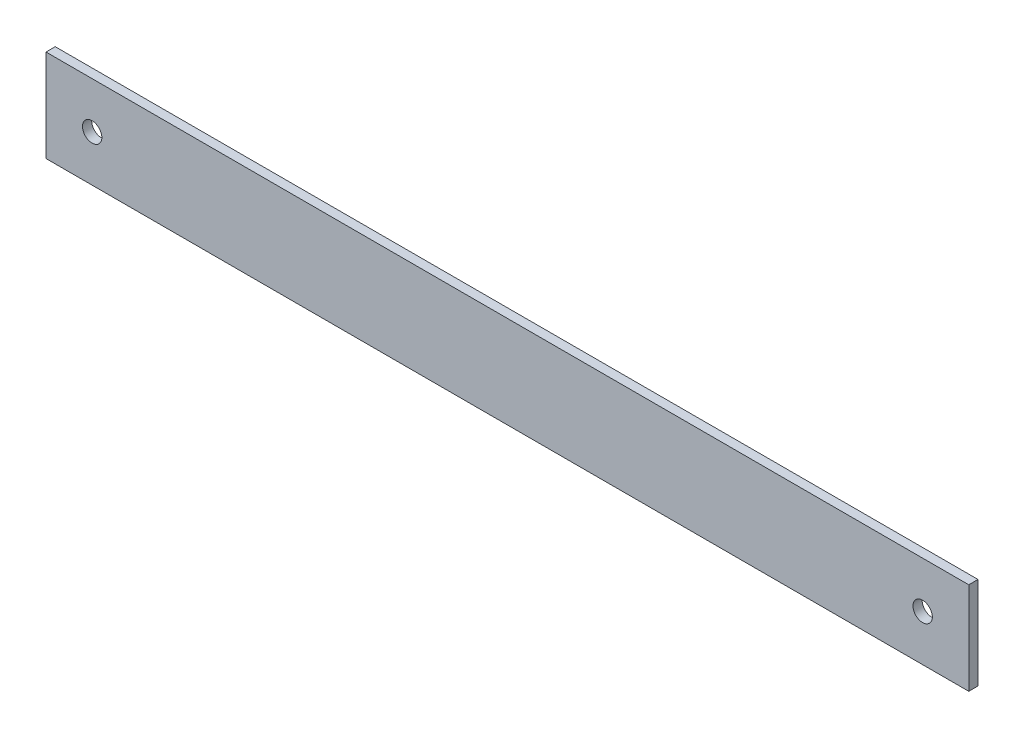
ISO-10303-21;
HEADER;
FILE_DESCRIPTION(('STEP AP214'),'2;1');
FILE_NAME('part.step','',(''),(''),'','','');
FILE_SCHEMA(('AUTOMOTIVE_DESIGN { 1 0 10303 214 1 1 1 1 }'));
ENDSEC;
DATA;
#1=APPLICATION_CONTEXT('core data for automotive mechanical design processes');
#2=APPLICATION_PROTOCOL_DEFINITION('international standard','automotive_design',2000,#1);
#3=PRODUCT_CONTEXT('',#1,'mechanical');
#4=PRODUCT('Part','Part','',(#3));
#5=PRODUCT_RELATED_PRODUCT_CATEGORY('part','',(#4));
#6=PRODUCT_DEFINITION_FORMATION('','',#4);
#7=PRODUCT_DEFINITION_CONTEXT('part definition',#1,'design');
#8=PRODUCT_DEFINITION('design','',#6,#7);
#9=PRODUCT_DEFINITION_SHAPE('','',#8);
#10=(LENGTH_UNIT() NAMED_UNIT(*) SI_UNIT(.MILLI.,.METRE.));
#11=(NAMED_UNIT(*) PLANE_ANGLE_UNIT() SI_UNIT($,.RADIAN.));
#12=(NAMED_UNIT(*) SI_UNIT($,.STERADIAN.) SOLID_ANGLE_UNIT());
#13=UNCERTAINTY_MEASURE_WITH_UNIT(LENGTH_MEASURE(1.E-05),#10,'distance_accuracy_value','');
#14=(GEOMETRIC_REPRESENTATION_CONTEXT(3) GLOBAL_UNCERTAINTY_ASSIGNED_CONTEXT((#13)) GLOBAL_UNIT_ASSIGNED_CONTEXT((#10,
#11,#12)) REPRESENTATION_CONTEXT('',''));
#15=CARTESIAN_POINT('',(0.,0.,0.));
#16=DIRECTION('',(0.,0.,1.));
#17=DIRECTION('',(1.,0.,0.));
#18=AXIS2_PLACEMENT_3D('',#15,#16,#17);
#19=CARTESIAN_POINT('',(-500.,-50.0000000000001,5.));
#20=DIRECTION('',(1.,0.,0.));
#21=DIRECTION('',(0.,0.,-1.));
#22=AXIS2_PLACEMENT_3D('',#19,#20,#21);
#23=PLANE('',#22);
#24=DIRECTION('',(0.,-1.,0.));
#25=VECTOR('',#24,1.);
#26=CARTESIAN_POINT('',(-500.,-50.0000000000001,-5.));
#27=LINE('',#26,#25);
#28=CARTESIAN_POINT('',(-500.,50.,-5.));
#29=VERTEX_POINT('',#28);
#30=CARTESIAN_POINT('',(-500.,-50.0000000000001,-5.));
#31=VERTEX_POINT('',#30);
#32=EDGE_CURVE('E99',#29,#31,#27,.T.);
#33=ORIENTED_EDGE('',*,*,#32,.T.);
#34=DIRECTION('',(0.,0.,-1.));
#35=VECTOR('',#34,1.);
#36=CARTESIAN_POINT('',(-500.,-50.0000000000001,5.));
#37=LINE('',#36,#35);
#38=CARTESIAN_POINT('',(-500.,-50.0000000000001,5.));
#39=VERTEX_POINT('',#38);
#40=EDGE_CURVE('E11',#39,#31,#37,.T.);
#41=ORIENTED_EDGE('',*,*,#40,.F.);
#42=DIRECTION('',(0.,-1.,0.));
#43=VECTOR('',#42,1.);
#44=CARTESIAN_POINT('',(-500.,-50.0000000000001,5.));
#45=LINE('',#44,#43);
#46=CARTESIAN_POINT('',(-500.,50.,5.));
#47=VERTEX_POINT('',#46);
#48=EDGE_CURVE('E87',#47,#39,#45,.T.);
#49=ORIENTED_EDGE('',*,*,#48,.F.);
#50=DIRECTION('',(0.,0.,-1.));
#51=VECTOR('',#50,1.);
#52=CARTESIAN_POINT('',(-500.,50.,5.));
#53=LINE('',#52,#51);
#54=EDGE_CURVE('E95',#47,#29,#53,.T.);
#55=ORIENTED_EDGE('',*,*,#54,.T.);
#56=EDGE_LOOP('',(#33,#41,#49,#55));
#57=FACE_BOUND('',#56,.T.);
#58=ADVANCED_FACE('F36',(#57),#23,.F.);
#59=CARTESIAN_POINT('',(500.,-50.,5.));
#60=DIRECTION('',(0.,1.,0.));
#61=DIRECTION('',(-1.,0.,0.));
#62=AXIS2_PLACEMENT_3D('',#59,#60,#61);
#63=PLANE('',#62);
#64=DIRECTION('',(1.,0.,0.));
#65=VECTOR('',#64,1.);
#66=CARTESIAN_POINT('',(500.,-50.,-5.));
#67=LINE('',#66,#65);
#68=CARTESIAN_POINT('',(500.,-50.,-5.));
#69=VERTEX_POINT('',#68);
#70=EDGE_CURVE('E91',#31,#69,#67,.T.);
#71=ORIENTED_EDGE('',*,*,#70,.T.);
#72=DIRECTION('',(0.,0.,-1.));
#73=VECTOR('',#72,1.);
#74=CARTESIAN_POINT('',(500.,-50.,5.));
#75=LINE('',#74,#73);
#76=CARTESIAN_POINT('',(500.,-50.,5.));
#77=VERTEX_POINT('',#76);
#78=EDGE_CURVE('E44',#77,#69,#75,.T.);
#79=ORIENTED_EDGE('',*,*,#78,.F.);
#80=DIRECTION('',(1.,0.,0.));
#81=VECTOR('',#80,1.);
#82=CARTESIAN_POINT('',(500.,-50.,5.));
#83=LINE('',#82,#81);
#84=EDGE_CURVE('E82',#39,#77,#83,.T.);
#85=ORIENTED_EDGE('',*,*,#84,.F.);
#86=ORIENTED_EDGE('',*,*,#40,.T.);
#87=EDGE_LOOP('',(#71,#79,#85,#86));
#88=FACE_BOUND('',#87,.T.);
#89=ADVANCED_FACE('F90',(#88),#63,.F.);
#90=CARTESIAN_POINT('',(500.,-50.,5.));
#91=DIRECTION('',(-1.,0.,0.));
#92=DIRECTION('',(0.,0.,1.));
#93=AXIS2_PLACEMENT_3D('',#90,#91,#92);
#94=PLANE('',#93);
#95=DIRECTION('',(0.,1.,0.));
#96=VECTOR('',#95,1.);
#97=CARTESIAN_POINT('',(500.,-50.,-5.));
#98=LINE('',#97,#96);
#99=CARTESIAN_POINT('',(500.,50.0000000000001,-5.));
#100=VERTEX_POINT('',#99);
#101=EDGE_CURVE('E69',#69,#100,#98,.T.);
#102=ORIENTED_EDGE('',*,*,#101,.T.);
#103=DIRECTION('',(0.,0.,-1.));
#104=VECTOR('',#103,1.);
#105=CARTESIAN_POINT('',(500.,50.0000000000001,5.));
#106=LINE('',#105,#104);
#107=CARTESIAN_POINT('',(500.,50.0000000000001,5.));
#108=VERTEX_POINT('',#107);
#109=EDGE_CURVE('E92',#108,#100,#106,.T.);
#110=ORIENTED_EDGE('',*,*,#109,.F.);
#111=DIRECTION('',(0.,1.,0.));
#112=VECTOR('',#111,1.);
#113=CARTESIAN_POINT('',(500.,-50.,5.));
#114=LINE('',#113,#112);
#115=EDGE_CURVE('E85',#77,#108,#114,.T.);
#116=ORIENTED_EDGE('',*,*,#115,.F.);
#117=ORIENTED_EDGE('',*,*,#78,.T.);
#118=EDGE_LOOP('',(#102,#110,#116,#117));
#119=FACE_BOUND('',#118,.T.);
#120=ADVANCED_FACE('F93',(#119),#94,.F.);
#121=CARTESIAN_POINT('',(500.,50.0000000000001,5.));
#122=DIRECTION('',(0.,-1.,0.));
#123=DIRECTION('',(1.,0.,0.));
#124=AXIS2_PLACEMENT_3D('',#121,#122,#123);
#125=PLANE('',#124);
#126=DIRECTION('',(-1.,0.,0.));
#127=VECTOR('',#126,1.);
#128=CARTESIAN_POINT('',(500.,50.0000000000001,-5.));
#129=LINE('',#128,#127);
#130=EDGE_CURVE('E75',#100,#29,#129,.T.);
#131=ORIENTED_EDGE('',*,*,#130,.T.);
#132=ORIENTED_EDGE('',*,*,#54,.F.);
#133=DIRECTION('',(-1.,0.,0.));
#134=VECTOR('',#133,1.);
#135=CARTESIAN_POINT('',(500.,50.0000000000001,5.));
#136=LINE('',#135,#134);
#137=EDGE_CURVE('E52',#108,#47,#136,.T.);
#138=ORIENTED_EDGE('',*,*,#137,.F.);
#139=ORIENTED_EDGE('',*,*,#109,.T.);
#140=EDGE_LOOP('',(#131,#132,#138,#139));
#141=FACE_BOUND('',#140,.T.);
#142=ADVANCED_FACE('F107',(#141),#125,.F.);
#143=CARTESIAN_POINT('',(0.,0.,5.));
#144=DIRECTION('',(0.,0.,1.));
#145=DIRECTION('',(1.,0.,0.));
#146=AXIS2_PLACEMENT_3D('',#143,#144,#145);
#147=PLANE('',#146);
#148=CARTESIAN_POINT('',(-450.,0.,5.));
#149=DIRECTION('',(0.,0.,1.));
#150=DIRECTION('',(1.,0.,0.));
#151=AXIS2_PLACEMENT_3D('',#148,#149,#150);
#152=CIRCLE('',#151,10.5);
#153=CARTESIAN_POINT('',(-439.5,0.,5.));
#154=VERTEX_POINT('',#153);
#155=EDGE_CURVE('E121',#154,#154,#152,.T.);
#156=ORIENTED_EDGE('',*,*,#155,.F.);
#157=EDGE_LOOP('',(#156));
#158=FACE_BOUND('',#157,.T.);
#159=CARTESIAN_POINT('',(450.,0.,5.));
#160=DIRECTION('',(0.,0.,1.));
#161=DIRECTION('',(1.,0.,0.));
#162=AXIS2_PLACEMENT_3D('',#159,#160,#161);
#163=CIRCLE('',#162,10.5);
#164=CARTESIAN_POINT('',(460.5,0.,5.));
#165=VERTEX_POINT('',#164);
#166=EDGE_CURVE('E115',#165,#165,#163,.T.);
#167=ORIENTED_EDGE('',*,*,#166,.F.);
#168=EDGE_LOOP('',(#167));
#169=FACE_BOUND('',#168,.T.);
#170=ORIENTED_EDGE('',*,*,#48,.T.);
#171=ORIENTED_EDGE('',*,*,#84,.T.);
#172=ORIENTED_EDGE('',*,*,#115,.T.);
#173=ORIENTED_EDGE('',*,*,#137,.T.);
#174=EDGE_LOOP('',(#170,#171,#172,#173));
#175=FACE_BOUND('',#174,.T.);
#176=ADVANCED_FACE('F83',(#158,#169,#175),#147,.T.);
#177=CARTESIAN_POINT('',(0.,0.,-5.));
#178=DIRECTION('',(0.,0.,1.));
#179=DIRECTION('',(1.,0.,0.));
#180=AXIS2_PLACEMENT_3D('',#177,#178,#179);
#181=PLANE('',#180);
#182=CARTESIAN_POINT('',(-450.,0.,-5.));
#183=DIRECTION('',(0.,0.,1.));
#184=DIRECTION('',(1.,0.,0.));
#185=AXIS2_PLACEMENT_3D('',#182,#183,#184);
#186=CIRCLE('',#185,10.5);
#187=CARTESIAN_POINT('',(-439.5,0.,-5.));
#188=VERTEX_POINT('',#187);
#189=EDGE_CURVE('E118',#188,#188,#186,.T.);
#190=ORIENTED_EDGE('',*,*,#189,.T.);
#191=EDGE_LOOP('',(#190));
#192=FACE_BOUND('',#191,.T.);
#193=CARTESIAN_POINT('',(450.,0.,-5.));
#194=DIRECTION('',(0.,0.,1.));
#195=DIRECTION('',(1.,0.,0.));
#196=AXIS2_PLACEMENT_3D('',#193,#194,#195);
#197=CIRCLE('',#196,10.5);
#198=CARTESIAN_POINT('',(460.5,0.,-5.));
#199=VERTEX_POINT('',#198);
#200=EDGE_CURVE('E102',#199,#199,#197,.T.);
#201=ORIENTED_EDGE('',*,*,#200,.T.);
#202=EDGE_LOOP('',(#201));
#203=FACE_BOUND('',#202,.T.);
#204=ORIENTED_EDGE('',*,*,#32,.F.);
#205=ORIENTED_EDGE('',*,*,#130,.F.);
#206=ORIENTED_EDGE('',*,*,#101,.F.);
#207=ORIENTED_EDGE('',*,*,#70,.F.);
#208=EDGE_LOOP('',(#204,#205,#206,#207));
#209=FACE_BOUND('',#208,.T.);
#210=ADVANCED_FACE('F110',(#192,#203,#209),#181,.F.);
#211=CARTESIAN_POINT('',(450.,0.,5.));
#212=DIRECTION('',(0.,0.,1.));
#213=DIRECTION('',(1.,0.,0.));
#214=AXIS2_PLACEMENT_3D('',#211,#212,#213);
#215=CYLINDRICAL_SURFACE('',#214,10.5);
#216=ORIENTED_EDGE('',*,*,#200,.F.);
#217=EDGE_LOOP('',(#216));
#218=FACE_BOUND('',#217,.T.);
#219=ORIENTED_EDGE('',*,*,#166,.T.);
#220=EDGE_LOOP('',(#219));
#221=FACE_BOUND('',#220,.T.);
#222=ADVANCED_FACE('F132',(#218,#221),#215,.F.);
#223=CARTESIAN_POINT('',(-450.,0.,5.));
#224=DIRECTION('',(0.,0.,1.));
#225=DIRECTION('',(1.,0.,0.));
#226=AXIS2_PLACEMENT_3D('',#223,#224,#225);
#227=CYLINDRICAL_SURFACE('',#226,10.5);
#228=ORIENTED_EDGE('',*,*,#189,.F.);
#229=EDGE_LOOP('',(#228));
#230=FACE_BOUND('',#229,.T.);
#231=ORIENTED_EDGE('',*,*,#155,.T.);
#232=EDGE_LOOP('',(#231));
#233=FACE_BOUND('',#232,.T.);
#234=ADVANCED_FACE('F125',(#230,#233),#227,.F.);
#235=CLOSED_SHELL('',(#58,#89,#120,#142,#176,#210,#222,#234));
#236=MANIFOLD_SOLID_BREP('B2',#235);
#237=ADVANCED_BREP_SHAPE_REPRESENTATION('',(#18,#236),#14);
#238=SHAPE_DEFINITION_REPRESENTATION(#9,#237);
ENDSEC;
END-ISO-10303-21;
